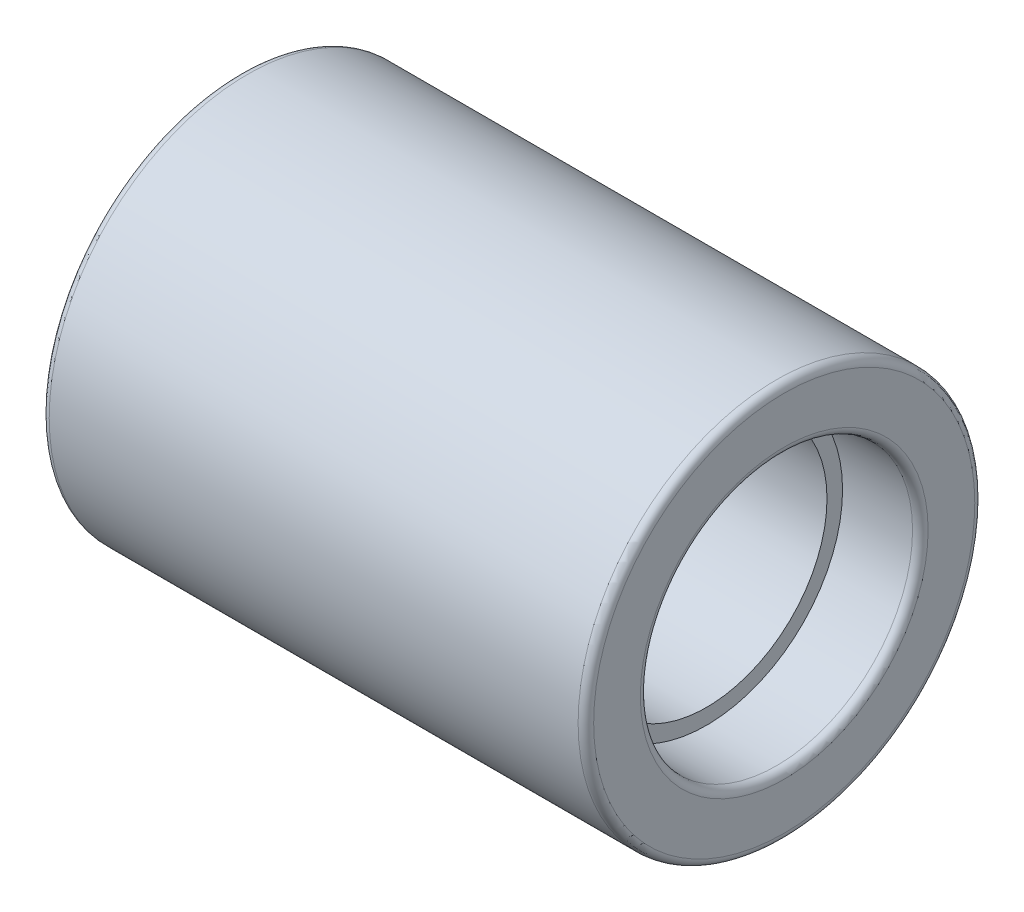
ISO-10303-21;
HEADER;
FILE_DESCRIPTION(('STEP AP214'),'2;1');
FILE_NAME('part.step','',(''),(''),'','','');
FILE_SCHEMA(('AUTOMOTIVE_DESIGN { 1 0 10303 214 1 1 1 1 }'));
ENDSEC;
DATA;
#1=APPLICATION_CONTEXT('core data for automotive mechanical design processes');
#2=APPLICATION_PROTOCOL_DEFINITION('international standard','automotive_design',2000,#1);
#3=PRODUCT_CONTEXT('',#1,'mechanical');
#4=PRODUCT('Part','Part','',(#3));
#5=PRODUCT_RELATED_PRODUCT_CATEGORY('part','',(#4));
#6=PRODUCT_DEFINITION_FORMATION('','',#4);
#7=PRODUCT_DEFINITION_CONTEXT('part definition',#1,'design');
#8=PRODUCT_DEFINITION('design','',#6,#7);
#9=PRODUCT_DEFINITION_SHAPE('','',#8);
#10=(LENGTH_UNIT() NAMED_UNIT(*) SI_UNIT(.MILLI.,.METRE.));
#11=(NAMED_UNIT(*) PLANE_ANGLE_UNIT() SI_UNIT($,.RADIAN.));
#12=(NAMED_UNIT(*) SI_UNIT($,.STERADIAN.) SOLID_ANGLE_UNIT());
#13=UNCERTAINTY_MEASURE_WITH_UNIT(LENGTH_MEASURE(1.E-05),#10,'distance_accuracy_value','');
#14=(GEOMETRIC_REPRESENTATION_CONTEXT(3) GLOBAL_UNCERTAINTY_ASSIGNED_CONTEXT((#13)) GLOBAL_UNIT_ASSIGNED_CONTEXT((#10,
#11,#12)) REPRESENTATION_CONTEXT('',''));
#15=CARTESIAN_POINT('',(0.,0.,0.));
#16=DIRECTION('',(0.,0.,1.));
#17=DIRECTION('',(1.,0.,0.));
#18=AXIS2_PLACEMENT_3D('',#15,#16,#17);
#19=CARTESIAN_POINT('',(70.,0.,0.));
#20=DIRECTION('',(-1.,0.,0.));
#21=DIRECTION('',(0.,0.,1.));
#22=AXIS2_PLACEMENT_3D('',#19,#20,#21);
#23=CYLINDRICAL_SURFACE('',#22,15.5);
#24=CARTESIAN_POINT('',(60.,0.,0.));
#25=DIRECTION('',(1.,0.,0.));
#26=DIRECTION('',(0.,0.,-1.));
#27=AXIS2_PLACEMENT_3D('',#24,#25,#26);
#28=CIRCLE('',#27,15.5);
#29=CARTESIAN_POINT('',(60.,0.,-15.5));
#30=VERTEX_POINT('',#29);
#31=EDGE_CURVE('E64',#30,#30,#28,.T.);
#32=ORIENTED_EDGE('',*,*,#31,.T.);
#33=EDGE_LOOP('',(#32));
#34=FACE_BOUND('',#33,.T.);
#35=CARTESIAN_POINT('',(10.,0.,0.));
#36=DIRECTION('',(-1.,0.,0.));
#37=DIRECTION('',(0.,0.,1.));
#38=AXIS2_PLACEMENT_3D('',#35,#36,#37);
#39=CIRCLE('',#38,15.5);
#40=CARTESIAN_POINT('',(10.,0.,15.5));
#41=VERTEX_POINT('',#40);
#42=EDGE_CURVE('E65',#41,#41,#39,.T.);
#43=ORIENTED_EDGE('',*,*,#42,.T.);
#44=EDGE_LOOP('',(#43));
#45=FACE_BOUND('',#44,.T.);
#46=ADVANCED_FACE('F32',(#34,#45),#23,.F.);
#47=CARTESIAN_POINT('',(70.,0.,0.));
#48=DIRECTION('',(1.,0.,0.));
#49=DIRECTION('',(0.,0.,-1.));
#50=AXIS2_PLACEMENT_3D('',#47,#48,#49);
#51=PLANE('',#50);
#52=CARTESIAN_POINT('',(70.,0.,0.));
#53=DIRECTION('',(1.,0.,0.));
#54=DIRECTION('',(0.,0.,-1.));
#55=AXIS2_PLACEMENT_3D('',#52,#53,#54);
#56=CIRCLE('',#55,18.5);
#57=CARTESIAN_POINT('',(70.,0.,-18.5));
#58=VERTEX_POINT('',#57);
#59=EDGE_CURVE('E10',#58,#58,#56,.F.);
#60=ORIENTED_EDGE('',*,*,#59,.T.);
#61=EDGE_LOOP('',(#60));
#62=FACE_BOUND('',#61,.T.);
#63=CARTESIAN_POINT('',(70.,0.,0.));
#64=DIRECTION('',(1.,0.,0.));
#65=DIRECTION('',(0.,0.,-1.));
#66=AXIS2_PLACEMENT_3D('',#63,#64,#65);
#67=CIRCLE('',#66,24.5);
#68=CARTESIAN_POINT('',(70.,0.,-24.5));
#69=VERTEX_POINT('',#68);
#70=EDGE_CURVE('E39',#69,#69,#67,.T.);
#71=ORIENTED_EDGE('',*,*,#70,.T.);
#72=EDGE_LOOP('',(#71));
#73=FACE_BOUND('',#72,.T.);
#74=ADVANCED_FACE('F95',(#62,#73),#51,.T.);
#75=CARTESIAN_POINT('',(0.,0.,0.));
#76=DIRECTION('',(1.,0.,0.));
#77=DIRECTION('',(0.,0.,-1.));
#78=AXIS2_PLACEMENT_3D('',#75,#76,#77);
#79=PLANE('',#78);
#80=CARTESIAN_POINT('',(0.,0.,0.));
#81=DIRECTION('',(1.,0.,0.));
#82=DIRECTION('',(0.,0.,-1.));
#83=AXIS2_PLACEMENT_3D('',#80,#81,#82);
#84=CIRCLE('',#83,18.5);
#85=CARTESIAN_POINT('',(0.,0.,-18.5));
#86=VERTEX_POINT('',#85);
#87=EDGE_CURVE('E55',#86,#86,#84,.T.);
#88=ORIENTED_EDGE('',*,*,#87,.T.);
#89=EDGE_LOOP('',(#88));
#90=FACE_BOUND('',#89,.T.);
#91=CARTESIAN_POINT('',(0.,0.,0.));
#92=DIRECTION('',(1.,0.,0.));
#93=DIRECTION('',(0.,0.,-1.));
#94=AXIS2_PLACEMENT_3D('',#91,#92,#93);
#95=CIRCLE('',#94,24.5);
#96=CARTESIAN_POINT('',(0.,0.,-24.5));
#97=VERTEX_POINT('',#96);
#98=EDGE_CURVE('E58',#97,#97,#95,.F.);
#99=ORIENTED_EDGE('',*,*,#98,.T.);
#100=EDGE_LOOP('',(#99));
#101=FACE_BOUND('',#100,.T.);
#102=ADVANCED_FACE('F101',(#90,#101),#79,.F.);
#103=CARTESIAN_POINT('',(70.,0.,0.));
#104=DIRECTION('',(-1.,0.,0.));
#105=DIRECTION('',(0.,0.,1.));
#106=AXIS2_PLACEMENT_3D('',#103,#104,#105);
#107=CYLINDRICAL_SURFACE('',#106,25.5);
#108=CARTESIAN_POINT('',(1.,0.,0.));
#109=DIRECTION('',(1.,0.,0.));
#110=DIRECTION('',(0.,0.,-1.));
#111=AXIS2_PLACEMENT_3D('',#108,#109,#110);
#112=CIRCLE('',#111,25.5);
#113=CARTESIAN_POINT('',(1.,0.,-25.5));
#114=VERTEX_POINT('',#113);
#115=EDGE_CURVE('E47',#114,#114,#112,.T.);
#116=ORIENTED_EDGE('',*,*,#115,.T.);
#117=EDGE_LOOP('',(#116));
#118=FACE_BOUND('',#117,.T.);
#119=CARTESIAN_POINT('',(69.,0.,0.));
#120=DIRECTION('',(1.,0.,0.));
#121=DIRECTION('',(0.,0.,-1.));
#122=AXIS2_PLACEMENT_3D('',#119,#120,#121);
#123=CIRCLE('',#122,25.5);
#124=CARTESIAN_POINT('',(69.,0.,-25.5));
#125=VERTEX_POINT('',#124);
#126=EDGE_CURVE('E52',#125,#125,#123,.F.);
#127=ORIENTED_EDGE('',*,*,#126,.T.);
#128=EDGE_LOOP('',(#127));
#129=FACE_BOUND('',#128,.T.);
#130=ADVANCED_FACE('F108',(#118,#129),#107,.T.);
#131=CARTESIAN_POINT('',(60.,0.,0.));
#132=DIRECTION('',(1.,0.,0.));
#133=DIRECTION('',(0.,0.,-1.));
#134=AXIS2_PLACEMENT_3D('',#131,#132,#133);
#135=CYLINDRICAL_SURFACE('',#134,17.5);
#136=CARTESIAN_POINT('',(69.,0.,0.));
#137=DIRECTION('',(1.,0.,0.));
#138=DIRECTION('',(0.,0.,-1.));
#139=AXIS2_PLACEMENT_3D('',#136,#137,#138);
#140=CIRCLE('',#139,17.5);
#141=CARTESIAN_POINT('',(69.,0.,-17.5));
#142=VERTEX_POINT('',#141);
#143=EDGE_CURVE('E43',#142,#142,#140,.T.);
#144=ORIENTED_EDGE('',*,*,#143,.T.);
#145=EDGE_LOOP('',(#144));
#146=FACE_BOUND('',#145,.T.);
#147=CARTESIAN_POINT('',(60.,0.,0.));
#148=DIRECTION('',(1.,0.,0.));
#149=DIRECTION('',(0.,0.,-1.));
#150=AXIS2_PLACEMENT_3D('',#147,#148,#149);
#151=CIRCLE('',#150,17.5);
#152=CARTESIAN_POINT('',(60.,0.,-17.5));
#153=VERTEX_POINT('',#152);
#154=EDGE_CURVE('E68',#153,#153,#151,.T.);
#155=ORIENTED_EDGE('',*,*,#154,.F.);
#156=EDGE_LOOP('',(#155));
#157=FACE_BOUND('',#156,.T.);
#158=ADVANCED_FACE('F91',(#146,#157),#135,.F.);
#159=CARTESIAN_POINT('',(60.,0.,0.));
#160=DIRECTION('',(1.,0.,0.));
#161=DIRECTION('',(0.,0.,-1.));
#162=AXIS2_PLACEMENT_3D('',#159,#160,#161);
#163=PLANE('',#162);
#164=ORIENTED_EDGE('',*,*,#31,.F.);
#165=EDGE_LOOP('',(#164));
#166=FACE_BOUND('',#165,.T.);
#167=ORIENTED_EDGE('',*,*,#154,.T.);
#168=EDGE_LOOP('',(#167));
#169=FACE_BOUND('',#168,.T.);
#170=ADVANCED_FACE('F81',(#166,#169),#163,.T.);
#171=CARTESIAN_POINT('',(10.,0.,0.));
#172=DIRECTION('',(-1.,0.,0.));
#173=DIRECTION('',(0.,0.,1.));
#174=AXIS2_PLACEMENT_3D('',#171,#172,#173);
#175=CYLINDRICAL_SURFACE('',#174,17.5);
#176=CARTESIAN_POINT('',(0.999999999999999,0.,0.));
#177=DIRECTION('',(1.,0.,0.));
#178=DIRECTION('',(0.,0.,-1.));
#179=AXIS2_PLACEMENT_3D('',#176,#177,#178);
#180=CIRCLE('',#179,17.5);
#181=CARTESIAN_POINT('',(0.999999999999999,0.,-17.5));
#182=VERTEX_POINT('',#181);
#183=EDGE_CURVE('E61',#182,#182,#180,.F.);
#184=ORIENTED_EDGE('',*,*,#183,.T.);
#185=EDGE_LOOP('',(#184));
#186=FACE_BOUND('',#185,.T.);
#187=CARTESIAN_POINT('',(10.,0.,0.));
#188=DIRECTION('',(-1.,0.,0.));
#189=DIRECTION('',(0.,0.,1.));
#190=AXIS2_PLACEMENT_3D('',#187,#188,#189);
#191=CIRCLE('',#190,17.5);
#192=CARTESIAN_POINT('',(10.,0.,17.5));
#193=VERTEX_POINT('',#192);
#194=EDGE_CURVE('E69',#193,#193,#191,.T.);
#195=ORIENTED_EDGE('',*,*,#194,.F.);
#196=EDGE_LOOP('',(#195));
#197=FACE_BOUND('',#196,.T.);
#198=ADVANCED_FACE('F79',(#186,#197),#175,.F.);
#199=CARTESIAN_POINT('',(10.,0.,0.));
#200=DIRECTION('',(-1.,0.,0.));
#201=DIRECTION('',(0.,0.,1.));
#202=AXIS2_PLACEMENT_3D('',#199,#200,#201);
#203=PLANE('',#202);
#204=ORIENTED_EDGE('',*,*,#42,.F.);
#205=EDGE_LOOP('',(#204));
#206=FACE_BOUND('',#205,.T.);
#207=ORIENTED_EDGE('',*,*,#194,.T.);
#208=EDGE_LOOP('',(#207));
#209=FACE_BOUND('',#208,.T.);
#210=ADVANCED_FACE('F77',(#206,#209),#203,.T.);
#211=CARTESIAN_POINT('',(0.999999999999999,0.,0.));
#212=DIRECTION('',(1.,0.,0.));
#213=DIRECTION('',(0.,0.,-1.));
#214=AXIS2_PLACEMENT_3D('',#211,#212,#213);
#215=TOROIDAL_SURFACE('',#214,18.5,1.);
#216=ORIENTED_EDGE('',*,*,#87,.F.);
#217=EDGE_LOOP('',(#216));
#218=FACE_BOUND('',#217,.T.);
#219=ORIENTED_EDGE('',*,*,#183,.F.);
#220=EDGE_LOOP('',(#219));
#221=FACE_BOUND('',#220,.T.);
#222=ADVANCED_FACE('F88',(#218,#221),#215,.T.);
#223=CARTESIAN_POINT('',(1.,0.,0.));
#224=DIRECTION('',(1.,0.,0.));
#225=DIRECTION('',(0.,0.,-1.));
#226=AXIS2_PLACEMENT_3D('',#223,#224,#225);
#227=TOROIDAL_SURFACE('',#226,24.5,1.);
#228=ORIENTED_EDGE('',*,*,#98,.F.);
#229=EDGE_LOOP('',(#228));
#230=FACE_BOUND('',#229,.T.);
#231=ORIENTED_EDGE('',*,*,#115,.F.);
#232=EDGE_LOOP('',(#231));
#233=FACE_BOUND('',#232,.T.);
#234=ADVANCED_FACE('F115',(#230,#233),#227,.T.);
#235=CARTESIAN_POINT('',(69.,0.,0.));
#236=DIRECTION('',(1.,0.,0.));
#237=DIRECTION('',(0.,0.,-1.));
#238=AXIS2_PLACEMENT_3D('',#235,#236,#237);
#239=TOROIDAL_SURFACE('',#238,18.5,1.);
#240=ORIENTED_EDGE('',*,*,#59,.F.);
#241=EDGE_LOOP('',(#240));
#242=FACE_BOUND('',#241,.T.);
#243=ORIENTED_EDGE('',*,*,#143,.F.);
#244=EDGE_LOOP('',(#243));
#245=FACE_BOUND('',#244,.T.);
#246=ADVANCED_FACE('F118',(#242,#245),#239,.T.);
#247=CARTESIAN_POINT('',(69.,0.,0.));
#248=DIRECTION('',(1.,0.,0.));
#249=DIRECTION('',(0.,0.,-1.));
#250=AXIS2_PLACEMENT_3D('',#247,#248,#249);
#251=TOROIDAL_SURFACE('',#250,24.5,1.);
#252=ORIENTED_EDGE('',*,*,#126,.F.);
#253=EDGE_LOOP('',(#252));
#254=FACE_BOUND('',#253,.T.);
#255=ORIENTED_EDGE('',*,*,#70,.F.);
#256=EDGE_LOOP('',(#255));
#257=FACE_BOUND('',#256,.T.);
#258=ADVANCED_FACE('F34',(#254,#257),#251,.T.);
#259=CLOSED_SHELL('',(#46,#74,#102,#130,#158,#170,#198,#210,#222,#234,#246,#258));
#260=MANIFOLD_SOLID_BREP('B2',#259);
#261=ADVANCED_BREP_SHAPE_REPRESENTATION('',(#18,#260),#14);
#262=SHAPE_DEFINITION_REPRESENTATION(#9,#261);
ENDSEC;
END-ISO-10303-21;
